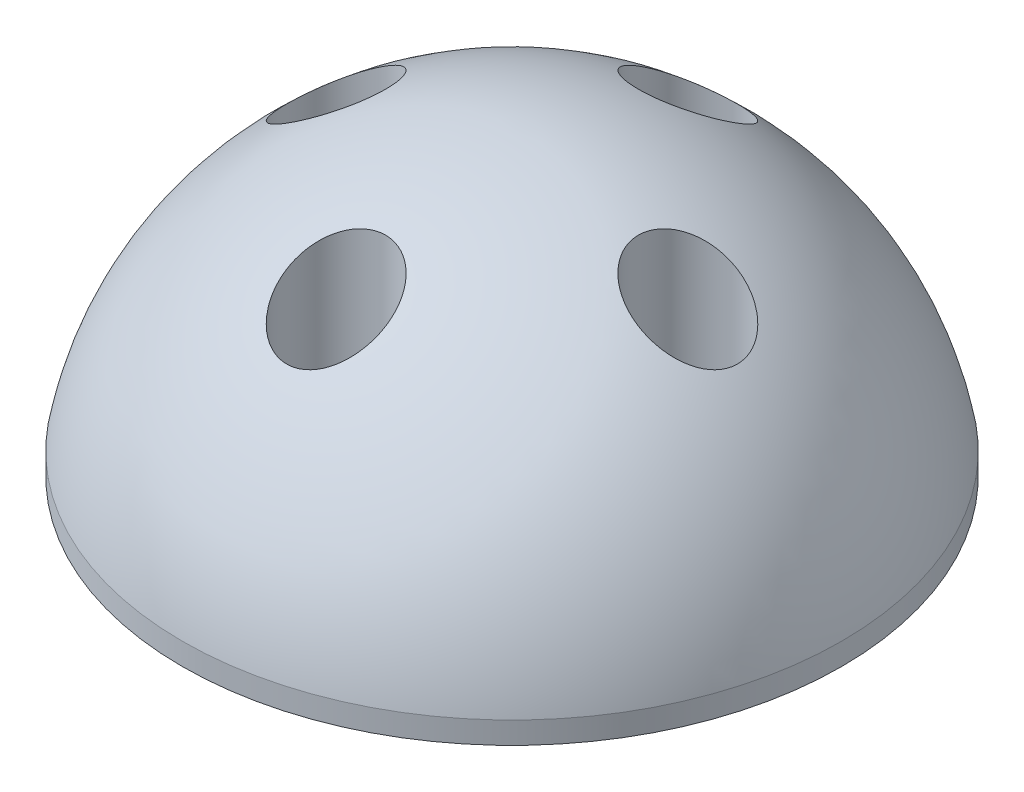
ISO-10303-21;
HEADER;
FILE_DESCRIPTION(('STEP AP214'),'2;1');
FILE_NAME('part.step','',(''),(''),'','','');
FILE_SCHEMA(('AUTOMOTIVE_DESIGN { 1 0 10303 214 1 1 1 1 }'));
ENDSEC;
DATA;
#1=APPLICATION_CONTEXT('core data for automotive mechanical design processes');
#2=APPLICATION_PROTOCOL_DEFINITION('international standard','automotive_design',2000,#1);
#3=PRODUCT_CONTEXT('',#1,'mechanical');
#4=PRODUCT('Part','Part','',(#3));
#5=PRODUCT_RELATED_PRODUCT_CATEGORY('part','',(#4));
#6=PRODUCT_DEFINITION_FORMATION('','',#4);
#7=PRODUCT_DEFINITION_CONTEXT('part definition',#1,'design');
#8=PRODUCT_DEFINITION('design','',#6,#7);
#9=PRODUCT_DEFINITION_SHAPE('','',#8);
#10=(LENGTH_UNIT() NAMED_UNIT(*) SI_UNIT(.MILLI.,.METRE.));
#11=(NAMED_UNIT(*) PLANE_ANGLE_UNIT() SI_UNIT($,.RADIAN.));
#12=(NAMED_UNIT(*) SI_UNIT($,.STERADIAN.) SOLID_ANGLE_UNIT());
#13=UNCERTAINTY_MEASURE_WITH_UNIT(LENGTH_MEASURE(1.E-05),#10,'distance_accuracy_value','');
#14=(GEOMETRIC_REPRESENTATION_CONTEXT(3) GLOBAL_UNCERTAINTY_ASSIGNED_CONTEXT((#13)) GLOBAL_UNIT_ASSIGNED_CONTEXT((#10,
#11,#12)) REPRESENTATION_CONTEXT('',''));
#15=CARTESIAN_POINT('',(0.,0.,0.));
#16=DIRECTION('',(0.,0.,1.));
#17=DIRECTION('',(1.,0.,0.));
#18=AXIS2_PLACEMENT_3D('',#15,#16,#17);
#19=CARTESIAN_POINT('',(0.,1.,0.));
#20=DIRECTION('',(0.,-1.,0.));
#21=DIRECTION('',(0.,0.,-1.));
#22=AXIS2_PLACEMENT_3D('',#19,#20,#21);
#23=CYLINDRICAL_SURFACE('',#22,15.);
#24=CARTESIAN_POINT('',(0.,1.,0.));
#25=DIRECTION('',(0.,1.,0.));
#26=DIRECTION('',(0.,0.,1.));
#27=AXIS2_PLACEMENT_3D('',#24,#25,#26);
#28=CIRCLE('',#27,15.);
#29=CARTESIAN_POINT('',(0.,1.,15.));
#30=VERTEX_POINT('',#29);
#31=EDGE_CURVE('E10',#30,#30,#28,.T.);
#32=ORIENTED_EDGE('',*,*,#31,.F.);
#33=EDGE_LOOP('',(#32));
#34=FACE_BOUND('',#33,.T.);
#35=CARTESIAN_POINT('',(0.,0.,0.));
#36=DIRECTION('',(0.,1.,0.));
#37=DIRECTION('',(0.,0.,1.));
#38=AXIS2_PLACEMENT_3D('',#35,#36,#37);
#39=CIRCLE('',#38,15.);
#40=CARTESIAN_POINT('',(0.,0.,15.));
#41=VERTEX_POINT('',#40);
#42=EDGE_CURVE('E38',#41,#41,#39,.T.);
#43=ORIENTED_EDGE('',*,*,#42,.T.);
#44=EDGE_LOOP('',(#43));
#45=FACE_BOUND('',#44,.T.);
#46=ADVANCED_FACE('F31',(#34,#45),#23,.T.);
#47=CARTESIAN_POINT('',(0.,0.,0.));
#48=DIRECTION('',(0.,1.,0.));
#49=DIRECTION('',(0.,0.,1.));
#50=AXIS2_PLACEMENT_3D('',#47,#48,#49);
#51=PLANE('',#50);
#52=CARTESIAN_POINT('',(-8.,0.,0.));
#53=DIRECTION('',(0.,-1.,0.));
#54=DIRECTION('',(1.,0.,0.));
#55=AXIS2_PLACEMENT_3D('',#52,#53,#54);
#56=CIRCLE('',#55,1.375);
#57=CARTESIAN_POINT('',(-6.625,0.,0.));
#58=VERTEX_POINT('',#57);
#59=EDGE_CURVE('E51',#58,#58,#56,.T.);
#60=ORIENTED_EDGE('',*,*,#59,.F.);
#61=EDGE_LOOP('',(#60));
#62=FACE_BOUND('',#61,.T.);
#63=CARTESIAN_POINT('',(0.,0.,-8.));
#64=DIRECTION('',(0.,-1.,0.));
#65=DIRECTION('',(0.,0.,1.));
#66=AXIS2_PLACEMENT_3D('',#63,#64,#65);
#67=CIRCLE('',#66,1.375);
#68=CARTESIAN_POINT('',(0.,0.,-6.625));
#69=VERTEX_POINT('',#68);
#70=EDGE_CURVE('E170',#69,#69,#67,.T.);
#71=ORIENTED_EDGE('',*,*,#70,.F.);
#72=EDGE_LOOP('',(#71));
#73=FACE_BOUND('',#72,.T.);
#74=CARTESIAN_POINT('',(8.,0.,0.));
#75=DIRECTION('',(0.,-1.,0.));
#76=DIRECTION('',(-1.,0.,0.));
#77=AXIS2_PLACEMENT_3D('',#74,#75,#76);
#78=CIRCLE('',#77,1.375);
#79=CARTESIAN_POINT('',(6.625,0.,0.));
#80=VERTEX_POINT('',#79);
#81=EDGE_CURVE('E172',#80,#80,#78,.T.);
#82=ORIENTED_EDGE('',*,*,#81,.F.);
#83=EDGE_LOOP('',(#82));
#84=FACE_BOUND('',#83,.T.);
#85=CARTESIAN_POINT('',(0.,0.,8.));
#86=DIRECTION('',(0.,-1.,0.));
#87=DIRECTION('',(0.,0.,-1.));
#88=AXIS2_PLACEMENT_3D('',#85,#86,#87);
#89=CIRCLE('',#88,1.375);
#90=CARTESIAN_POINT('',(0.,0.,6.625));
#91=VERTEX_POINT('',#90);
#92=EDGE_CURVE('E43',#91,#91,#89,.T.);
#93=ORIENTED_EDGE('',*,*,#92,.F.);
#94=EDGE_LOOP('',(#93));
#95=FACE_BOUND('',#94,.T.);
#96=ORIENTED_EDGE('',*,*,#42,.F.);
#97=EDGE_LOOP('',(#96));
#98=FACE_BOUND('',#97,.T.);
#99=ADVANCED_FACE('F102',(#62,#73,#84,#95,#98),#51,.F.);
#100=CARTESIAN_POINT('',(0.,-1.74999999999999,0.));
#101=DIRECTION('',(0.,-1.,0.));
#102=DIRECTION('',(1.,0.,0.));
#103=AXIS2_PLACEMENT_3D('',#100,#101,#102);
#104=SPHERICAL_SURFACE('',#103,15.25);
#105=CARTESIAN_POINT('',(-1.44939926503516,9.91037997957821,-9.72097117074058));
#106=CARTESIAN_POINT('',(-1.55753639028746,9.97286645131404,-9.62989232811992));
#107=CARTESIAN_POINT('',(-1.65531452125126,10.040826611451,-9.53009502438769));
#108=CARTESIAN_POINT('',(-1.82907759571313,10.18417611645,-9.31753765402247));
#109=CARTESIAN_POINT('',(-1.90501270070655,10.2595819318576,-9.20474875260493));
#110=CARTESIAN_POINT('',(-2.03422856788474,10.4145178118002,-8.97065442894932));
#111=CARTESIAN_POINT('',(-2.08763841885442,10.4940213620761,-8.84940230869914));
#112=CARTESIAN_POINT('',(-2.17222975098161,10.6552932584435,-8.60095046624146));
#113=CARTESIAN_POINT('',(-2.20342015356581,10.7370606818421,-8.47375315299891));
#114=CARTESIAN_POINT('',(-2.24571580913105,10.9106030397579,-8.20109365501086));
#115=CARTESIAN_POINT('',(-2.25405651127421,11.002433649087,-8.05523051011659));
#116=CARTESIAN_POINT('',(-2.24228415838746,11.1842572743215,-7.7633291595774));
#117=CARTESIAN_POINT('',(-2.22214940919226,11.2742488361347,-7.6172909052433));
#118=CARTESIAN_POINT('',(-2.15229963313588,11.4512699278702,-7.32715182819221));
#119=CARTESIAN_POINT('',(-2.10211961254348,11.5382296594951,-7.18311867544966));
#120=CARTESIAN_POINT('',(-1.97147317884518,11.7047099641709,-6.90485571153108));
#121=CARTESIAN_POINT('',(-1.89104996300138,11.7842409466115,-6.77061224243894));
#122=CARTESIAN_POINT('',(-1.72288918267863,11.9152157153829,-6.54782044671053));
#123=CARTESIAN_POINT('',(-1.6412751876572,11.9688754067362,-6.45593328094426));
#124=CARTESIAN_POINT('',(-1.46152875525929,12.0682902994611,-6.28483249653054));
#125=CARTESIAN_POINT('',(-1.36340422824459,12.1140492649779,-6.20561284403239));
#126=CARTESIAN_POINT('',(-1.15175316513579,12.1961563308302,-6.06290168328497));
#127=CARTESIAN_POINT('',(-1.03813648982296,12.2324454357509,-5.99950887431793));
#128=CARTESIAN_POINT('',(-0.799032294503142,12.2934832246265,-5.89259496041249));
#129=CARTESIAN_POINT('',(-0.673552477799625,12.3182393364256,-5.84906106568278));
#130=CARTESIAN_POINT('',(-0.429721805476774,12.3527719138515,-5.7882554797348));
#131=CARTESIAN_POINT('',(-0.312163130041493,12.3639229762541,-5.76857553066206));
#132=CARTESIAN_POINT('',(-0.0749118359341102,12.3755227127939,-5.74810282220485));
#133=CARTESIAN_POINT('',(0.0447796684070115,12.3759768206301,-5.74730047362406));
#134=CARTESIAN_POINT('',(0.273983702838342,12.3665178418211,-5.76399627686657));
#135=CARTESIAN_POINT('',(0.383622762836628,12.3573274649437,-5.7802186821262));
#136=CARTESIAN_POINT('',(0.598275348546068,12.3300846208255,-5.8282125663884));
#137=CARTESIAN_POINT('',(0.703288961594765,12.3120323209935,-5.85998375166211));
#138=CARTESIAN_POINT('',(0.907564429773527,12.2674569390585,-5.93821258891502));
#139=CARTESIAN_POINT('',(1.00672042833327,12.2408144857661,-5.98487710426091));
#140=CARTESIAN_POINT('',(1.19552964802438,12.1800997849856,-6.09082746759711));
#141=CARTESIAN_POINT('',(1.28518020910026,12.1460254658348,-6.15011683470651));
#142=CARTESIAN_POINT('',(1.46065280941568,12.0683326785431,-6.28470697467165));
#143=CARTESIAN_POINT('',(1.54550944597059,12.0241506773429,-6.36093792688761));
#144=CARTESIAN_POINT('',(1.70122759197386,11.9295942575242,-6.52318360614259));
#145=CARTESIAN_POINT('',(1.77208290308634,11.8792171122766,-6.6092026398941));
#146=CARTESIAN_POINT('',(1.90732882660972,11.7667751262805,-6.80002075856474));
#147=CARTESIAN_POINT('',(1.96975229527907,11.7040386316007,-6.90581709338097));
#148=CARTESIAN_POINT('',(2.07588239748621,11.573858111756,-7.12369059440206));
#149=CARTESIAN_POINT('',(2.11957926261992,11.5064116509997,-7.2357710041989));
#150=CARTESIAN_POINT('',(2.19301918244425,11.3588432092539,-7.47902339905344));
#151=CARTESIAN_POINT('',(2.2200640155828,11.2782431597585,-7.61072219237385));
#152=CARTESIAN_POINT('',(2.25049755078715,11.1146973239077,-7.87539134262225));
#153=CARTESIAN_POINT('',(2.25387506599088,11.0317504468696,-8.00836227112143));
#154=CARTESIAN_POINT('',(2.23651498525113,10.8569192185404,-8.28587272756411));
#155=CARTESIAN_POINT('',(2.21331232432847,10.7649767456394,-8.43022733497413));
#156=CARTESIAN_POINT('',(2.13905134785191,10.5829056747608,-8.7129832685379));
#157=CARTESIAN_POINT('',(2.08797099857956,10.4927785701001,-8.85137979212347));
#158=CARTESIAN_POINT('',(1.95720338170618,10.315943511406,-9.12005872134845));
#159=CARTESIAN_POINT('',(1.87708691998855,10.22930976149,-9.2501829985555));
#160=CARTESIAN_POINT('',(1.68879399326153,10.0648722486334,-9.4947202071397));
#161=CARTESIAN_POINT('',(1.58067196938884,9.98705177044164,-9.60916296969372));
#162=CARTESIAN_POINT('',(1.37325963340152,9.86585873428572,-9.78589875357593));
#163=CARTESIAN_POINT('',(1.28060338007034,9.8190614549035,-9.85366327224271));
#164=CARTESIAN_POINT('',(1.0830065634869,9.73442408736816,-9.9756118647176));
#165=CARTESIAN_POINT('',(0.978074308345092,9.69657799307902,-10.0298050461716));
#166=CARTESIAN_POINT('',(0.757149773153857,9.63183431563998,-10.12218219432));
#167=CARTESIAN_POINT('',(0.641080590166459,9.60502079940393,-10.1602433002798));
#168=CARTESIAN_POINT('',(0.40209783650282,9.56484154515619,-10.2171736139344));
#169=CARTESIAN_POINT('',(0.279190348970403,9.55146405052528,-10.23605960016));
#170=CARTESIAN_POINT('',(0.0469971998769583,9.54008186001084,-10.2521296366751));
#171=CARTESIAN_POINT('',(-0.0620416139044836,9.54034437443422,-10.2517598702495));
#172=CARTESIAN_POINT('',(-0.278324075675924,9.55196621478245,-10.2353495778451));
#173=CARTESIAN_POINT('',(-0.385567887667622,9.56332452124028,-10.2193104915431));
#174=CARTESIAN_POINT('',(-0.590662141653247,9.59565385802585,-10.1735238795463));
#175=CARTESIAN_POINT('',(-0.688717961416461,9.61620015110733,-10.1443817787475));
#176=CARTESIAN_POINT('',(-0.878109249429696,9.66560434692044,-10.0740364665));
#177=CARTESIAN_POINT('',(-0.969446430846786,9.69446012155249,-10.0328363431266));
#178=CARTESIAN_POINT('',(-1.12791674457398,9.75321639604519,-9.94854424017289));
#179=CARTESIAN_POINT('',(-1.19641882189885,9.78195734345236,-9.90718117015471));
#180=CARTESIAN_POINT('',(-1.32745628132129,9.84337455989514,-9.81841334138899));
#181=CARTESIAN_POINT('',(-1.3899910331651,9.87605124379054,-9.77100794569868));
#182=CARTESIAN_POINT('',(-1.44939926503516,9.91037997957821,-9.72097117074058));
#183=B_SPLINE_CURVE_WITH_KNOTS('',3,(#105,#106,#107,#108,#109,#110,#111,#112,#113,#114,#115,
#116,#117,#118,#119,#120,#121,#122,#123,#124,#125,#126,#127,#128,#129,#130,#131,#132,#133,#134,
#135,#136,#137,#138,#139,#140,#141,#142,#143,#144,#145,#146,#147,#148,#149,#150,#151,#152,#153,
#154,#155,#156,#157,#158,#159,#160,#161,#162,#163,#164,#165,#166,#167,#168,#169,#170,#171,#172,
#173,#174,#175,#176,#177,#178,#179,#180,#181,#182),.UNSPECIFIED.,.T.,.F.,(4,2,2,2,2,2,2,2,2,2,2,
2,2,2,2,2,2,2,2,2,2,2,2,2,2,2,2,2,2,2,2,2,2,2,2,2,2,2,4),(0.,0.463381419812173,0.92781188404503,
1.38954336037231,1.85108934024941,2.36642747933686,2.88215844293605,3.40608520882776,
3.92926645939435,4.32992605145905,4.73039422724624,5.13330069710613,5.53594731437824,
5.89318030071941,6.25023182060585,6.58231637239128,6.91439465107638,7.25130228747646,
7.58830395854729,7.95381359964854,8.31948468980851,8.73164534472841,9.14402073510117,
9.61235600893284,10.0809126364866,10.5966987150199,11.1128930475719,11.6370513196303,
12.1601982081796,12.5306439891106,12.9008404957597,13.2738078259151,13.6464485218114,
13.9718817508107,14.297285082238,14.6089917045173,14.9206185680684,15.1751635892817,
15.4297354652054),.UNSPECIFIED.);
#184=CARTESIAN_POINT('',(-1.44939926503516,9.91037997957821,-9.72097117074058));
#185=VERTEX_POINT('',#184);
#186=EDGE_CURVE('E236',#185,#185,#183,.T.);
#187=ORIENTED_EDGE('',*,*,#186,.F.);
#188=EDGE_LOOP('',(#187));
#189=FACE_BOUND('',#188,.T.);
#190=CARTESIAN_POINT('',(9.3118631479231,10.1877631754542,-1.82798114900603));
#191=CARTESIAN_POINT('',(9.17499467317678,10.2794820032948,-1.92620023843682));
#192=CARTESIAN_POINT('',(9.02903842710733,10.3762185541791,-2.00763274366949));
#193=CARTESIAN_POINT('',(8.72556251941894,10.5748094416303,-2.13620318368798));
#194=CARTESIAN_POINT('',(8.56800673987517,10.6766794224116,-2.18322854346389));
#195=CARTESIAN_POINT('',(8.26716239451514,10.8687741577365,-2.23863855362489));
#196=CARTESIAN_POINT('',(8.12453252381125,10.9588736835668,-2.25109729203282));
#197=CARTESIAN_POINT('',(7.83871080105058,11.1375364869626,-2.24875259119156));
#198=CARTESIAN_POINT('',(7.69551972453097,11.2261013220266,-2.23397865045771));
#199=CARTESIAN_POINT('',(7.40662153735848,11.4030297719659,-2.17554327917133));
#200=CARTESIAN_POINT('',(7.2610476854913,11.491239734308,-2.13073525756814));
#201=CARTESIAN_POINT('',(6.97854588017341,11.6608334666695,-2.01063760490342));
#202=CARTESIAN_POINT('',(6.84161824502729,11.7422169854141,-1.93534685239621));
#203=CARTESIAN_POINT('',(6.59348594528057,11.8885165807754,-1.76214972496717));
#204=CARTESIAN_POINT('',(6.48108882949479,11.9542395378083,-1.66664790091339));
#205=CARTESIAN_POINT('',(6.27454226605322,12.0742875747271,-1.4516963099501));
#206=CARTESIAN_POINT('',(6.18036811224357,12.1286280949534,-1.33227942005502));
#207=CARTESIAN_POINT('',(6.02844382916166,12.215905705915,-1.09205584836815));
#208=CARTESIAN_POINT('',(5.96736487216066,12.2508207662912,-0.974074276416953));
#209=CARTESIAN_POINT('',(5.86638619570202,12.3084017070218,-0.726622631136961));
#210=CARTESIAN_POINT('',(5.82646202442883,12.3310817298284,-0.597166024265667));
#211=CARTESIAN_POINT('',(5.77424985470585,12.360711849006,-0.349721336581895));
#212=CARTESIAN_POINT('',(5.75894152385788,12.3693818683521,-0.232568320002699));
#213=CARTESIAN_POINT('',(5.74691924520478,12.3761922185896,0.0029760895927413));
#214=CARTESIAN_POINT('',(5.75019698897675,12.3743372544019,0.121366905661497));
#215=CARTESIAN_POINT('',(5.77436049693795,12.3606439079919,0.348171734908263));
#216=CARTESIAN_POINT('',(5.7941307177224,12.3494380044517,0.456746233258493));
#217=CARTESIAN_POINT('',(5.84887061090577,12.3183442569035,0.668670390857834));
#218=CARTESIAN_POINT('',(5.88384055437397,12.2984562580605,0.77201995688969));
#219=CARTESIAN_POINT('',(5.96843493250253,12.25020118885,0.973370533728332));
#220=CARTESIAN_POINT('',(6.01838374598722,12.2216462432915,1.07118931923119));
#221=CARTESIAN_POINT('',(6.13059539593385,12.157246623375,1.25682235552224));
#222=CARTESIAN_POINT('',(6.192861961034,12.1213997416223,1.34463356425575));
#223=CARTESIAN_POINT('',(6.33370619858222,12.0399420665577,1.51637392875694));
#224=CARTESIAN_POINT('',(6.41325153810211,11.9937402651579,1.59922668596096));
#225=CARTESIAN_POINT('',(6.58178362864816,11.8952880978466,1.75042797775998));
#226=CARTESIAN_POINT('',(6.67077465136287,11.8430349943307,1.81876990774125));
#227=CARTESIAN_POINT('',(6.86777709498188,11.7266231596952,1.94838789887908));
#228=CARTESIAN_POINT('',(6.9767575884188,11.661799623962,2.00759264831799));
#229=CARTESIAN_POINT('',(7.20053243391502,11.5276499637102,2.10673941866689));
#230=CARTESIAN_POINT('',(7.31532980275389,11.4583214974465,2.1466713288336));
#231=CARTESIAN_POINT('',(7.56367763943427,11.3070901491596,2.21149734292456));
#232=CARTESIAN_POINT('',(7.6976776826392,11.2247481767652,2.2336550017497));
#233=CARTESIAN_POINT('',(7.96626308978209,11.0580735325247,2.25377903262564));
#234=CARTESIAN_POINT('',(8.10084870003961,10.9737399398247,2.25173398666376));
#235=CARTESIAN_POINT('',(8.38002279196547,10.7970370981523,2.22251679120829));
#236=CARTESIAN_POINT('',(8.52436522057736,10.7046562000776,2.19300542216439));
#237=CARTESIAN_POINT('',(8.80612768247516,10.5223376975535,2.10580704759386));
#238=CARTESIAN_POINT('',(8.94354229091621,10.432402032477,2.04809832881228));
#239=CARTESIAN_POINT('',(9.20739096892856,10.257888079989,1.90455728001718));
#240=CARTESIAN_POINT('',(9.33379318404907,10.1733255140988,1.81864658153924));
#241=CARTESIAN_POINT('',(9.56980133487906,10.0139068173393,1.6192509235582));
#242=CARTESIAN_POINT('',(9.67944301441332,9.93903008429269,1.50582601746863));
#243=CARTESIAN_POINT('',(9.84569420577663,9.82458969111819,1.29162967755319));
#244=CARTESIAN_POINT('',(9.90828950059812,9.78121317486628,1.19750768574837));
#245=CARTESIAN_POINT('',(10.0197821085223,9.7036015627878,0.997999881559525));
#246=CARTESIAN_POINT('',(10.06868940304,9.66935980666819,0.892622354696768));
#247=CARTESIAN_POINT('',(10.1505278122677,9.61188355945163,0.672052253394602));
#248=CARTESIAN_POINT('',(10.1833461454569,9.58872679861861,0.556796863010462));
#249=CARTESIAN_POINT('',(10.2302680668558,9.55557370262242,0.320705063236427));
#250=CARTESIAN_POINT('',(10.2443846572916,9.54556822418106,0.199872591810419));
#251=CARTESIAN_POINT('',(10.2523764736312,9.5399059918864,-0.0285995176470327));
#252=CARTESIAN_POINT('',(10.2484227031872,9.54271023359965,-0.136132190389769));
#253=CARTESIAN_POINT('',(10.2253823032102,9.55902067126726,-0.348706717884452));
#254=CARTESIAN_POINT('',(10.2062982336439,9.57252505681368,-0.453748990902702));
#255=CARTESIAN_POINT('',(10.1547815295319,9.6088648509215,-0.655750974718902));
#256=CARTESIAN_POINT('',(10.1227101605322,9.63144761299152,-0.752850060568632));
#257=CARTESIAN_POINT('',(10.0467565223149,9.6847103928787,-0.93994277667585));
#258=CARTESIAN_POINT('',(10.002868221996,9.71539454531137,-1.02993274817935));
#259=CARTESIAN_POINT('',(9.90007763385895,9.78690410925218,-1.20995822256822));
#260=CARTESIAN_POINT('',(9.84011425536744,9.82843588995477,-1.29910246996318));
#261=CARTESIAN_POINT('',(9.7101396167428,9.91789448945606,-1.46598296136204));
#262=CARTESIAN_POINT('',(9.64013394067942,9.96581775320481,-1.54372549707797));
#263=CARTESIAN_POINT('',(9.52593206712948,10.0434658012903,-1.65443753352468));
#264=CARTESIAN_POINT('',(9.48457739944596,10.0714879373215,-1.69162094543679));
#265=CARTESIAN_POINT('',(9.39975530048486,10.1287515890462,-1.76245271852147));
#266=CARTESIAN_POINT('',(9.35628793277794,10.1579930680463,-1.79610118596349));
#267=CARTESIAN_POINT('',(9.3118631479231,10.1877631754542,-1.82798114900603));
#268=B_SPLINE_CURVE_WITH_KNOTS('',3,(#190,#191,#192,#193,#194,#195,#196,#197,#198,#199,#200,
#201,#202,#203,#204,#205,#206,#207,#208,#209,#210,#211,#212,#213,#214,#215,#216,#217,#218,#219,
#220,#221,#222,#223,#224,#225,#226,#227,#228,#229,#230,#231,#232,#233,#234,#235,#236,#237,#238,
#239,#240,#241,#242,#243,#244,#245,#246,#247,#248,#249,#250,#251,#252,#253,#254,#255,#256,#257,
#258,#259,#260,#261,#262,#263,#264,#265,#266,#267),.UNSPECIFIED.,.T.,.F.,(4,2,2,2,2,2,2,2,2,2,2,
2,2,2,2,2,2,2,2,2,2,2,2,2,2,2,2,2,2,2,2,2,2,2,2,2,2,2,4),(0.,0.57514533925969,1.15216415403988,
1.6575106357345,2.16231004632923,2.687569887803,3.21284905510142,3.69439883578572,
4.17529109949698,4.58496271962688,4.99415978105788,5.34769993532537,5.70108206109359,
6.03233390240133,6.36359165144082,6.7026164036898,7.04174393770794,7.41166316320176,
7.78175039848459,8.19991573701731,8.6183002118734,9.09281908485895,9.56756182862448,
10.0868410145706,10.6065207010397,11.1276568886919,11.6476657031001,12.0094642606035,
12.3709982997829,12.7350316439938,13.0988117640953,13.4201153724676,13.7413646295677,
14.0542322430223,14.367259840893,14.7115187827683,15.055587034475,15.2422733869516,
15.4289541255529),.UNSPECIFIED.);
#269=CARTESIAN_POINT('',(9.3118631479231,10.1877631754542,-1.82798114900603));
#270=VERTEX_POINT('',#269);
#271=EDGE_CURVE('E60',#270,#270,#268,.T.);
#272=ORIENTED_EDGE('',*,*,#271,.F.);
#273=EDGE_LOOP('',(#272));
#274=FACE_BOUND('',#273,.T.);
#275=CARTESIAN_POINT('',(-1.92759306885052,10.288734996467,9.16055373030253));
#276=CARTESIAN_POINT('',(-1.86264496764097,10.2170528414282,9.26842189471487));
#277=CARTESIAN_POINT('',(-1.7878867907352,10.1475179767008,9.37208909271781));
#278=CARTESIAN_POINT('',(-1.61906823573737,10.015219174497,9.56775061287258));
#279=CARTESIAN_POINT('',(-1.52497879217263,9.95246565245974,9.65972701630707));
#280=CARTESIAN_POINT('',(-1.33436203467533,9.84570659266776,9.81512442987307));
#281=CARTESIAN_POINT('',(-1.24043742116043,9.80030205217763,9.88076162657637));
#282=CARTESIAN_POINT('',(-1.04070635807505,9.71866977136673,9.99820513020227));
#283=CARTESIAN_POINT('',(-0.934911153396397,9.68243345027044,10.0500243721775));
#284=CARTESIAN_POINT('',(-0.712750028391606,9.62107028333923,10.1374824299878));
#285=CARTESIAN_POINT('',(-0.596311400093322,9.59602799164279,10.1729981495701));
#286=CARTESIAN_POINT('',(-0.357191722530516,9.55942873736379,10.2248231122881));
#287=CARTESIAN_POINT('',(-0.23451554324996,9.54786141789594,10.241147106304));
#288=CARTESIAN_POINT('',(-0.00344247588537207,9.53975941076964,10.2525837543686));
#289=CARTESIAN_POINT('',(0.104781397997663,9.54149655220274,10.2501348546414));
#290=CARTESIAN_POINT('',(0.319021493376862,9.55584912902544,10.2298641533908));
#291=CARTESIAN_POINT('',(0.425038080409001,9.56846274831131,10.2120449183344));
#292=CARTESIAN_POINT('',(0.628378251501909,9.60312950972995,10.1629208721408));
#293=CARTESIAN_POINT('',(0.725873894231089,9.62485342660121,10.1320861777555));
#294=CARTESIAN_POINT('',(0.913921334676605,9.67648461922886,10.0585070513144));
#295=CARTESIAN_POINT('',(1.00447143373711,9.70639388874013,10.0157597175799));
#296=CARTESIAN_POINT('',(1.18537791723015,9.7762154354557,9.9154802074527));
#297=CARTESIAN_POINT('',(1.27490551431889,9.81680636308518,9.85693189337411));
#298=CARTESIAN_POINT('',(1.4428447987153,9.90448136163653,9.72968674437064));
#299=CARTESIAN_POINT('',(1.52125056562719,9.95156886471748,9.6609845437433));
#300=CARTESIAN_POINT('',(1.67837131657619,10.058916157382,9.5033016523347));
#301=CARTESIAN_POINT('',(1.75499585741803,10.1200667784004,9.41284607536557));
#302=CARTESIAN_POINT('',(1.89197449009418,10.2470917217823,9.22336471032576));
#303=CARTESIAN_POINT('',(1.95231860387658,10.3129689098287,9.12433371538493));
#304=CARTESIAN_POINT('',(2.06546544562134,10.4593099462941,8.90243525324327));
#305=CARTESIAN_POINT('',(2.11522139429147,10.540343858875,8.77838491385994));
#306=CARTESIAN_POINT('',(2.19198740104546,10.7043977854711,8.52467011655922));
#307=CARTESIAN_POINT('',(2.21898469881972,10.7874188868734,8.39500255195502));
#308=CARTESIAN_POINT('',(2.25164540752186,10.9626957055615,8.11849100381988));
#309=CARTESIAN_POINT('',(2.25463099121893,11.0549612057782,7.97132843950644));
#310=CARTESIAN_POINT('',(2.23165852223935,11.2371353827117,7.67766386126106));
#311=CARTESIAN_POINT('',(2.20568578518202,11.3270428400242,7.53116222031323));
#312=CARTESIAN_POINT('',(2.12405000929359,11.5023338702655,7.24271034918922));
#313=CARTESIAN_POINT('',(2.06824621811057,11.5876938696775,7.10078510613228));
#314=CARTESIAN_POINT('',(1.92664380105403,11.7504507184267,6.82777724404966));
#315=CARTESIAN_POINT('',(1.84089046204912,11.8278593636238,6.69667862203884));
#316=CARTESIAN_POINT('',(1.66465003470599,11.953973754551,6.48150486963055));
#317=CARTESIAN_POINT('',(1.58036253076893,12.005086156281,6.39373911660053));
#318=CARTESIAN_POINT('',(1.39609910579021,12.0992657201048,6.23125330506438));
#319=CARTESIAN_POINT('',(1.29613115277821,12.142336944113,6.15652666124636));
#320=CARTESIAN_POINT('',(1.08178677215451,12.2189805477208,6.02306670622157));
#321=CARTESIAN_POINT('',(0.967329331171646,12.2524957755441,5.96442969804583));
#322=CARTESIAN_POINT('',(0.727655113854467,12.3080537431815,5.86699407372581));
#323=CARTESIAN_POINT('',(0.602444775909377,12.3301032931306,5.82818368163886));
#324=CARTESIAN_POINT('',(0.359603438658921,12.3598140545542,5.77583391322539));
#325=CARTESIAN_POINT('',(0.242620029703251,12.3687748347353,5.76001301433941));
#326=CARTESIAN_POINT('',(0.00731010817956907,12.3761845488363,5.74693290831934));
#327=CARTESIAN_POINT('',(-0.111015782065533,12.3746381694663,5.74966542544838));
#328=CARTESIAN_POINT('',(-0.337911020732221,12.3615411202472,5.77277769508829));
#329=CARTESIAN_POINT('',(-0.44663166925891,12.3506140746959,5.79205737696644));
#330=CARTESIAN_POINT('',(-0.658930254947215,12.3200537676255,5.84586366548065));
#331=CARTESIAN_POINT('',(-0.762508116558348,12.3004203782473,5.88039049603238));
#332=CARTESIAN_POINT('',(-0.96426547849636,12.2526775435639,5.9641000388208));
#333=CARTESIAN_POINT('',(-1.06227354208246,12.2243891910644,6.01359181137589));
#334=CARTESIAN_POINT('',(-1.2483546488339,12.1605033848222,6.1249321275343));
#335=CARTESIAN_POINT('',(-1.33642471428802,12.1249037493707,6.18678435938691));
#336=CARTESIAN_POINT('',(-1.5086926394587,12.043972399328,6.32675639174019));
#337=CARTESIAN_POINT('',(-1.59182980604503,11.9980533525068,6.40583896474321));
#338=CARTESIAN_POINT('',(-1.74367315006861,11.9001454188064,6.57349553809774));
#339=CARTESIAN_POINT('',(-1.81237243910919,11.8481536529177,6.66207403871583));
#340=CARTESIAN_POINT('',(-1.94279707856365,11.7322896413893,6.85822717386926));
#341=CARTESIAN_POINT('',(-2.00246408796006,11.6677509884714,6.96677582718791));
#342=CARTESIAN_POINT('',(-2.1026003055858,11.5341515941598,7.18973662528871));
#343=CARTESIAN_POINT('',(-2.14306250197185,11.4650892115702,7.30415089479082));
#344=CARTESIAN_POINT('',(-2.20909397087492,11.3144020652428,7.55173738017897));
#345=CARTESIAN_POINT('',(-2.2319402714189,11.2323342070681,7.68536837691267));
#346=CARTESIAN_POINT('',(-2.25354036448462,11.0660826982114,7.9534342874779));
#347=CARTESIAN_POINT('',(-2.25226255634448,10.9818964166568,8.08787002512174));
#348=CARTESIAN_POINT('',(-2.22469110641973,10.8052347739462,8.3671631336711));
#349=CARTESIAN_POINT('',(-2.19599641806244,10.7127431327674,8.51177497095542));
#350=CARTESIAN_POINT('',(-2.11045890810591,10.5303896309544,8.79376819563768));
#351=CARTESIAN_POINT('',(-2.05370190583974,10.440520631739,8.93117022353088));
#352=CARTESIAN_POINT('',(-1.96552431647301,10.3317571083193,9.09572699314));
#353=CARTESIAN_POINT('',(-1.94699648255597,10.3101502262215,9.12832783638475));
#354=CARTESIAN_POINT('',(-1.92759306885052,10.288734996467,9.16055373030253));
#355=B_SPLINE_CURVE_WITH_KNOTS('',3,(#275,#276,#277,#278,#279,#280,#281,#282,#283,#284,#285,
#286,#287,#288,#289,#290,#291,#292,#293,#294,#295,#296,#297,#298,#299,#300,#301,#302,#303,#304,
#305,#306,#307,#308,#309,#310,#311,#312,#313,#314,#315,#316,#317,#318,#319,#320,#321,#322,#323,
#324,#325,#326,#327,#328,#329,#330,#331,#332,#333,#334,#335,#336,#337,#338,#339,#340,#341,#342,
#343,#344,#345,#346,#347,#348,#349,#350,#351,#352,#353,#354),.UNSPECIFIED.,.T.,.F.,(4,2,2,2,2,2,
2,2,2,2,2,2,2,2,2,2,2,2,2,2,2,2,2,2,2,2,2,2,2,2,2,2,2,2,2,2,2,2,2,4),(0.,0.434558191787552,
0.869774607670535,1.23802530215759,1.60593005555495,1.97656866706635,2.34692221679521,
2.67006943261215,2.99316270125489,3.30546861565673,3.61785066807088,3.959786129076,
4.30190293224361,4.70056082950287,5.09946250655262,5.56647269230006,6.0337445472734,
6.55249223371842,7.07150308992554,7.59298470214082,8.11368116908689,8.50800966200353,
8.90213842196187,9.2985771507154,9.69478014164272,10.0480772999816,10.4012168807516,
10.7325513767851,11.0638907388726,11.4026039143422,11.7414183100797,12.1107058488257,
12.4801691788478,12.8975244130247,13.3150319102121,13.7884980805744,14.2625844969094,
14.7823995408167,15.3006346438901,15.4304600308886),.UNSPECIFIED.);
#356=CARTESIAN_POINT('',(-1.92759306885052,10.288734996467,9.16055373030253));
#357=VERTEX_POINT('',#356);
#358=EDGE_CURVE('E56',#357,#357,#355,.T.);
#359=ORIENTED_EDGE('',*,*,#358,.F.);
#360=EDGE_LOOP('',(#359));
#361=FACE_BOUND('',#360,.T.);
#362=CARTESIAN_POINT('',(-9.71396757494951,9.91518404487504,-1.45767456999961));
#363=CARTESIAN_POINT('',(-9.78518073834118,9.86634736594571,-1.37394668283048));
#364=CARTESIAN_POINT('',(-9.85117243312397,9.82078031280843,-1.28391312974622));
#365=CARTESIAN_POINT('',(-9.97035741416121,9.73808012984728,-1.09219917118741));
#366=CARTESIAN_POINT('',(-10.023559788512,9.70094101218614,-0.990527112332898));
#367=CARTESIAN_POINT('',(-10.1149288492328,9.63693024996834,-0.77664925825208));
#368=CARTESIAN_POINT('',(-10.1529896867802,9.61013092496393,-0.664375870143031));
#369=CARTESIAN_POINT('',(-10.2111414560507,9.56910635087761,-0.433057231620487));
#370=CARTESIAN_POINT('',(-10.2312447137319,9.55487247703613,-0.314016685923378));
#371=CARTESIAN_POINT('',(-10.2510229880268,9.54086682569798,-0.0852491646157559));
#372=CARTESIAN_POINT('',(-10.252508635164,9.53981323692848,0.0242457991812379));
#373=CARTESIAN_POINT('',(-10.2396197137024,9.54894265701938,0.241804759901348));
#374=CARTESIAN_POINT('',(-10.2252480009513,9.55912364257741,0.349869010943616));
#375=CARTESIAN_POINT('',(-10.1825823340714,9.58926328701822,0.556252800213472));
#376=CARTESIAN_POINT('',(-10.1549850358638,9.60873248093811,0.654791288701172));
#377=CARTESIAN_POINT('',(-10.0875813626,9.65610609217797,0.845418815867969));
#378=CARTESIAN_POINT('',(-10.0477724747915,9.68401224553574,0.937506522388793));
#379=CARTESIAN_POINT('',(-9.9538759384265,9.7495277461443,1.12086070524982));
#380=CARTESIAN_POINT('',(-9.89888772229024,9.78774338379903,1.21144599782603));
#381=CARTESIAN_POINT('',(-9.77858663493863,9.87085805434259,1.38204245736228));
#382=CARTESIAN_POINT('',(-9.71326857886224,9.9157604428511,1.46204827693521));
#383=CARTESIAN_POINT('',(-9.56305268723052,10.0183551729017,1.62275051764349));
#384=CARTESIAN_POINT('',(-9.47669435222368,10.0769442591379,1.70150697759945));
#385=CARTESIAN_POINT('',(-9.29517785608483,10.1990959777725,1.84345063608314));
#386=CARTESIAN_POINT('',(-9.20001435804227,10.2626616228817,1.90662830598315));
#387=CARTESIAN_POINT('',(-8.98592191122097,10.4044681870476,2.02682627593793));
#388=CARTESIAN_POINT('',(-8.86573608217185,10.4833403700864,2.08087106046491));
#389=CARTESIAN_POINT('',(-8.61925224806429,10.6434818660734,2.16704721544249));
#390=CARTESIAN_POINT('',(-8.4929508036749,10.7247525176127,2.19916609813928));
#391=CARTESIAN_POINT('',(-8.22154393102109,10.897672959131,2.24377659331658));
#392=CARTESIAN_POINT('',(-8.07600812489972,10.9893921201453,2.25343304870157));
#393=CARTESIAN_POINT('',(-7.78460013729292,11.1710937611367,2.24440753882935));
#394=CARTESIAN_POINT('',(-7.63872781232343,11.2610752317799,2.22570957730737));
#395=CARTESIAN_POINT('',(-7.34827933613006,11.4384624333711,2.15879188574258));
#396=CARTESIAN_POINT('',(-7.20377811041466,11.5257888166985,2.11002801757535));
#397=CARTESIAN_POINT('',(-6.92431363497976,11.6931382624023,1.98215473113176));
#398=CARTESIAN_POINT('',(-6.78933766639468,11.7731711069703,1.903086721283));
#399=CARTESIAN_POINT('',(-6.56470385255421,11.9053306737709,1.73700061031977));
#400=CARTESIAN_POINT('',(-6.47179548757317,11.9596248143823,1.65607839971773));
#401=CARTESIAN_POINT('',(-6.29855613470341,12.0603451728599,1.47750922172596));
#402=CARTESIAN_POINT('',(-6.21821923204026,12.1067750916333,1.37987016503839));
#403=CARTESIAN_POINT('',(-6.07320246269497,12.190248236911,1.16894279651351));
#404=CARTESIAN_POINT('',(-6.00862181272008,12.2272320465279,1.05556203246227));
#405=CARTESIAN_POINT('',(-5.89933467057009,12.2896448765381,0.816650537230055));
#406=CARTESIAN_POINT('',(-5.85461511369275,12.3150814929634,0.691127859430548));
#407=CARTESIAN_POINT('',(-5.79168549669422,12.3508267142659,0.44708498378029));
#408=CARTESIAN_POINT('',(-5.77103698357116,12.3625279347796,0.329394548002407));
#409=CARTESIAN_POINT('',(-5.74870662319749,12.3751809768806,0.091678691684211));
#410=CARTESIAN_POINT('',(-5.74701486749821,12.3761384141031,-0.0283454761769864));
#411=CARTESIAN_POINT('',(-5.76210415541063,12.3675899525124,-0.258114545272516));
#412=CARTESIAN_POINT('',(-5.77756524667486,12.3588317033446,-0.367977854640528));
#413=CARTESIAN_POINT('',(-5.82411191877612,12.3324139369629,-0.583208900561957));
#414=CARTESIAN_POINT('',(-5.85519706311804,12.3147546684201,-0.688576762617175));
#415=CARTESIAN_POINT('',(-5.93206827955518,12.2709625028197,-0.893468976878272));
#416=CARTESIAN_POINT('',(-5.97803484560117,12.2447255277897,-0.992902852128324));
#417=CARTESIAN_POINT('',(-6.08265466583482,12.1847917549796,-1.18237480385602));
#418=CARTESIAN_POINT('',(-6.14131138956411,12.1510929170358,-1.27241030077819));
#419=CARTESIAN_POINT('',(-6.27457483336736,12.0741960740366,-1.44865678614768));
#420=CARTESIAN_POINT('',(-6.35010275687879,12.0304408841805,-1.5339257212368));
#421=CARTESIAN_POINT('',(-6.51101391898115,11.9367079736536,-1.69057602193757));
#422=CARTESIAN_POINT('',(-6.5964014623031,11.8867275342704,-1.7619512847376));
#423=CARTESIAN_POINT('',(-6.78590138280406,11.7751271751789,-1.8983565135112));
#424=CARTESIAN_POINT('',(-6.89101609217416,11.7128346489861,-1.96144191895632));
#425=CARTESIAN_POINT('',(-7.10762371094395,11.5834995463301,-2.06901182502647));
#426=CARTESIAN_POINT('',(-7.21911995145517,11.5164544846432,-2.11348650845184));
#427=CARTESIAN_POINT('',(-7.46126541103315,11.3696735480788,-2.18870779867408));
#428=CARTESIAN_POINT('',(-7.59245747143458,11.2894516537241,-2.21676540910422));
#429=CARTESIAN_POINT('',(-7.8562496586471,11.1265930261363,-2.2493376111665));
#430=CARTESIAN_POINT('',(-7.98885037106385,11.0439552613946,-2.25384199412569));
#431=CARTESIAN_POINT('',(-8.26592110006333,10.8695722686908,-2.23896026216282));
#432=CARTESIAN_POINT('',(-8.41022052245729,10.7777587034345,-2.21708770116029));
#433=CARTESIAN_POINT('',(-8.69309311043282,10.5958008301302,-2.14556046900423));
#434=CARTESIAN_POINT('',(-8.83166047181017,10.5056582627188,-2.09587834368852));
#435=CARTESIAN_POINT('',(-9.1046864259076,10.3261504032555,-1.96621509575521));
#436=CARTESIAN_POINT('',(-9.23870479316931,10.2369891163356,-1.88501111940091));
#437=CARTESIAN_POINT('',(-9.49030680563878,10.0678765416756,-1.69304646711319));
#438=CARTESIAN_POINT('',(-9.6079260623056,9.98790536575905,-1.58235140477329));
#439=CARTESIAN_POINT('',(-9.71396757494951,9.91518404487504,-1.45767456999961));
#440=B_SPLINE_CURVE_WITH_KNOTS('',3,(#362,#363,#364,#365,#366,#367,#368,#369,#370,#371,#372,
#373,#374,#375,#376,#377,#378,#379,#380,#381,#382,#383,#384,#385,#386,#387,#388,#389,#390,#391,
#392,#393,#394,#395,#396,#397,#398,#399,#400,#401,#402,#403,#404,#405,#406,#407,#408,#409,#410,
#411,#412,#413,#414,#415,#416,#417,#418,#419,#420,#421,#422,#423,#424,#425,#426,#427,#428,#429,
#430,#431,#432,#433,#434,#435,#436,#437,#438,#439),.UNSPECIFIED.,.T.,.F.,(4,2,2,2,2,2,2,2,2,2,2,
2,2,2,2,2,2,2,2,2,2,2,2,2,2,2,2,2,2,2,2,2,2,2,2,2,2,2,4),(0.,0.360393092674859,
0.720529327787727,1.08314067322741,1.44550293307885,1.77231556500864,2.09906934888128,
2.4102398575438,2.72147443808571,3.05812538682266,3.39494585037231,3.78568879090106,
4.17667013632997,4.63556220526501,5.09471541560409,5.60925859985915,6.1240921738492,
6.64852847839921,7.17225071872605,7.57451970876513,7.97659886162992,8.38114808108504,
8.78543079095139,9.14368606894445,9.50175408285868,9.83406711091986,10.1663708555421,
10.5028663392595,10.8394539387607,11.2040564874727,11.5688188286642,11.9797193560684,
12.3908363620635,12.8578553182175,13.325076677581,13.8400064357078,14.3554454417158,
14.8932833934313,15.4299345808456),.UNSPECIFIED.);
#441=CARTESIAN_POINT('',(-9.71396757494951,9.91518404487504,-1.45767456999961));
#442=VERTEX_POINT('',#441);
#443=EDGE_CURVE('E52',#442,#442,#440,.T.);
#444=ORIENTED_EDGE('',*,*,#443,.F.);
#445=EDGE_LOOP('',(#444));
#446=FACE_BOUND('',#445,.T.);
#447=ORIENTED_EDGE('',*,*,#31,.T.);
#448=EDGE_LOOP('',(#447));
#449=FACE_BOUND('',#448,.T.);
#450=ADVANCED_FACE('F107',(#189,#274,#361,#446,#449),#104,.T.);
#451=CARTESIAN_POINT('',(0.,13.501,8.));
#452=DIRECTION('',(0.,-1.,0.));
#453=DIRECTION('',(0.,0.,-1.));
#454=AXIS2_PLACEMENT_3D('',#451,#452,#453);
#455=CYLINDRICAL_SURFACE('',#454,1.375);
#456=CARTESIAN_POINT('',(0.,0.500000000000032,8.));
#457=DIRECTION('',(0.,-1.,0.));
#458=DIRECTION('',(1.,0.,0.));
#459=AXIS2_PLACEMENT_3D('',#456,#457,#458);
#460=CIRCLE('',#459,1.375);
#461=CARTESIAN_POINT('',(0.,0.500000000000025,6.625));
#462=VERTEX_POINT('',#461);
#463=EDGE_CURVE('E53',#462,#462,#460,.F.);
#464=CARTESIAN_POINT('',(0.,0.500000000000025,6.625));
#465=CARTESIAN_POINT('',(0.,0.494791666666691,6.625));
#466=CARTESIAN_POINT('',(0.,0.489583333333358,6.625));
#467=CARTESIAN_POINT('',(0.,0.479166666666691,6.625));
#468=CARTESIAN_POINT('',(0.,0.473958333333357,6.625));
#469=CARTESIAN_POINT('',(0.,0.46354166666669,6.625));
#470=CARTESIAN_POINT('',(0.,0.458333333333356,6.625));
#471=CARTESIAN_POINT('',(0.,0.447916666666689,6.625));
#472=CARTESIAN_POINT('',(0.,0.442708333333355,6.625));
#473=CARTESIAN_POINT('',(0.,0.432291666666688,6.625));
#474=CARTESIAN_POINT('',(0.,0.427083333333355,6.625));
#475=CARTESIAN_POINT('',(0.,0.416666666666687,6.625));
#476=CARTESIAN_POINT('',(0.,0.411458333333353,6.625));
#477=CARTESIAN_POINT('',(0.,0.401041666666686,6.625));
#478=CARTESIAN_POINT('',(0.,0.395833333333353,6.625));
#479=CARTESIAN_POINT('',(0.,0.385416666666686,6.625));
#480=CARTESIAN_POINT('',(0.,0.380208333333352,6.625));
#481=CARTESIAN_POINT('',(0.,0.369791666666684,6.625));
#482=CARTESIAN_POINT('',(0.,0.364583333333351,6.625));
#483=CARTESIAN_POINT('',(0.,0.354166666666684,6.625));
#484=CARTESIAN_POINT('',(0.,0.348958333333351,6.625));
#485=CARTESIAN_POINT('',(0.,0.338541666666684,6.625));
#486=CARTESIAN_POINT('',(0.,0.33333333333335,6.625));
#487=CARTESIAN_POINT('',(0.,0.322916666666683,6.625));
#488=CARTESIAN_POINT('',(0.,0.317708333333349,6.625));
#489=CARTESIAN_POINT('',(0.,0.307291666666682,6.625));
#490=CARTESIAN_POINT('',(0.,0.302083333333348,6.625));
#491=CARTESIAN_POINT('',(0.,0.291666666666681,6.625));
#492=CARTESIAN_POINT('',(0.,0.286458333333347,6.625));
#493=CARTESIAN_POINT('',(0.,0.27604166666668,6.625));
#494=CARTESIAN_POINT('',(0.,0.270833333333346,6.625));
#495=CARTESIAN_POINT('',(0.,0.260416666666679,6.625));
#496=CARTESIAN_POINT('',(0.,0.255208333333346,6.625));
#497=CARTESIAN_POINT('',(0.,0.244791666666679,6.625));
#498=CARTESIAN_POINT('',(0.,0.239583333333346,6.625));
#499=CARTESIAN_POINT('',(0.,0.229166666666678,6.625));
#500=CARTESIAN_POINT('',(0.,0.223958333333345,6.625));
#501=CARTESIAN_POINT('',(0.,0.213541666666677,6.625));
#502=CARTESIAN_POINT('',(0.,0.208333333333344,6.625));
#503=CARTESIAN_POINT('',(0.,0.197916666666677,6.625));
#504=CARTESIAN_POINT('',(0.,0.192708333333343,6.625));
#505=CARTESIAN_POINT('',(0.,0.182291666666676,6.625));
#506=CARTESIAN_POINT('',(0.,0.177083333333342,6.625));
#507=CARTESIAN_POINT('',(0.,0.166666666666675,6.625));
#508=CARTESIAN_POINT('',(0.,0.161458333333341,6.625));
#509=CARTESIAN_POINT('',(0.,0.151041666666674,6.625));
#510=CARTESIAN_POINT('',(0.,0.14583333333334,6.625));
#511=CARTESIAN_POINT('',(0.,0.135416666666674,6.625));
#512=CARTESIAN_POINT('',(0.,0.13020833333334,6.625));
#513=CARTESIAN_POINT('',(0.,0.119791666666673,6.625));
#514=CARTESIAN_POINT('',(0.,0.114583333333339,6.625));
#515=CARTESIAN_POINT('',(0.,0.104166666666672,6.625));
#516=CARTESIAN_POINT('',(0.,0.0989583333333386,6.625));
#517=CARTESIAN_POINT('',(0.,0.0885416666666714,6.625));
#518=CARTESIAN_POINT('',(0.,0.0833333333333375,6.625));
#519=CARTESIAN_POINT('',(0.,0.0729166666666702,6.625));
#520=CARTESIAN_POINT('',(0.,0.0677083333333369,6.625));
#521=CARTESIAN_POINT('',(0.,0.0572916666666696,6.625));
#522=CARTESIAN_POINT('',(0.,0.0520833333333357,6.625));
#523=CARTESIAN_POINT('',(0.,0.0416666666666684,6.625));
#524=CARTESIAN_POINT('',(0.,0.0364583333333351,6.625));
#525=CARTESIAN_POINT('',(0.,0.0260416666666678,6.625));
#526=CARTESIAN_POINT('',(0.,0.0208333333333339,6.625));
#527=CARTESIAN_POINT('',(0.,0.0104166666666667,6.625));
#528=CARTESIAN_POINT('',(0.,0.00520833333333334,6.625));
#529=CARTESIAN_POINT('',(0.,0.,6.625));
#530=B_SPLINE_CURVE_WITH_KNOTS('',3,(#464,#465,#466,#467,#468,#469,#470,#471,#472,#473,#474,
#475,#476,#477,#478,#479,#480,#481,#482,#483,#484,#485,#486,#487,#488,#489,#490,#491,#492,#493,
#494,#495,#496,#497,#498,#499,#500,#501,#502,#503,#504,#505,#506,#507,#508,#509,#510,#511,#512,
#513,#514,#515,#516,#517,#518,#519,#520,#521,#522,#523,#524,#525,#526,#527,#528,#529),
.UNSPECIFIED.,.F.,.F.,(4,2,2,2,2,2,2,2,2,2,2,2,2,2,2,2,2,2,2,2,2,2,2,2,2,2,2,2,2,2,2,2,4),(0.,
0.015625,0.0312500000000018,0.0468750000000018,0.0625000000000035,0.0781250000000035,
0.0937500000000053,0.109375000000005,0.125000000000007,0.140625000000007,0.156250000000007,
0.171875000000009,0.187500000000009,0.203125000000011,0.218750000000011,0.234375000000012,
0.250000000000012,0.265625000000012,0.281250000000014,0.296875000000014,0.312500000000016,
0.328125000000016,0.343750000000018,0.359375000000018,0.375000000000018,0.390625000000019,
0.406250000000019,0.421875000000021,0.437500000000021,0.453125000000023,0.468750000000023,
0.484375000000025,0.500000000000025),.UNSPECIFIED.);
#531=EDGE_CURVE('BSEAM115',#462,#91,#530,.T.);
#532=ORIENTED_EDGE('',*,*,#463,.T.);
#533=ORIENTED_EDGE('',*,*,#92,.T.);
#534=ORIENTED_EDGE('',*,*,#531,.T.);
#535=ORIENTED_EDGE('',*,*,#531,.F.);
#536=EDGE_LOOP('',(#532,#534,#533,#535));
#537=FACE_BOUND('',#536,.T.);
#538=ADVANCED_FACE('F115',(#537),#455,.F.);
#539=CARTESIAN_POINT('',(7.99999999999995,13.5010000000002,0.));
#540=DIRECTION('',(0.,-1.,0.));
#541=DIRECTION('',(1.,0.,0.));
#542=AXIS2_PLACEMENT_3D('',#539,#540,#541);
#543=CYLINDRICAL_SURFACE('',#542,1.375);
#544=CARTESIAN_POINT('',(8.,0.500000000000063,0.));
#545=DIRECTION('',(0.,-1.,0.));
#546=DIRECTION('',(1.,0.,0.));
#547=AXIS2_PLACEMENT_3D('',#544,#545,#546);
#548=CIRCLE('',#547,1.375);
#549=CARTESIAN_POINT('',(9.375,0.500000000000074,0.));
#550=VERTEX_POINT('',#549);
#551=EDGE_CURVE('E57',#550,#550,#548,.F.);
#552=ORIENTED_EDGE('',*,*,#551,.T.);
#553=EDGE_LOOP('',(#552));
#554=FACE_BOUND('',#553,.T.);
#555=ORIENTED_EDGE('',*,*,#81,.T.);
#556=EDGE_LOOP('',(#555));
#557=FACE_BOUND('',#556,.T.);
#558=ADVANCED_FACE('F123',(#554,#557),#543,.F.);
#559=CARTESIAN_POINT('',(-1.07355321755663E-13,13.5010000000001,-8.));
#560=DIRECTION('',(0.,-1.,0.));
#561=DIRECTION('',(1.,0.,0.));
#562=AXIS2_PLACEMENT_3D('',#559,#560,#561);
#563=CYLINDRICAL_SURFACE('',#562,1.375);
#564=CARTESIAN_POINT('',(0.,0.500000000000032,-8.));
#565=DIRECTION('',(0.,-1.,0.));
#566=DIRECTION('',(0.,0.,-1.));
#567=AXIS2_PLACEMENT_3D('',#564,#565,#566);
#568=CIRCLE('',#567,1.375);
#569=CARTESIAN_POINT('',(0.,0.500000000000037,-9.375));
#570=VERTEX_POINT('',#569);
#571=EDGE_CURVE('E34',#570,#570,#568,.F.);
#572=ORIENTED_EDGE('',*,*,#571,.T.);
#573=EDGE_LOOP('',(#572));
#574=FACE_BOUND('',#573,.T.);
#575=ORIENTED_EDGE('',*,*,#70,.T.);
#576=EDGE_LOOP('',(#575));
#577=FACE_BOUND('',#576,.T.);
#578=ADVANCED_FACE('F127',(#574,#577),#563,.F.);
#579=CARTESIAN_POINT('',(-8.00000000000005,13.5010000000001,1.37901839389768E-13));
#580=DIRECTION('',(0.,-1.,0.));
#581=DIRECTION('',(0.,0.,-1.));
#582=AXIS2_PLACEMENT_3D('',#579,#580,#581);
#583=CYLINDRICAL_SURFACE('',#582,1.375);
#584=CARTESIAN_POINT('',(-8.,0.5,0.));
#585=DIRECTION('',(0.,-1.,0.));
#586=DIRECTION('',(0.,0.,-1.));
#587=AXIS2_PLACEMENT_3D('',#584,#585,#586);
#588=CIRCLE('',#587,1.375);
#589=CARTESIAN_POINT('',(-8.,0.5,-1.37499999999991));
#590=VERTEX_POINT('',#589);
#591=EDGE_CURVE('E48',#590,#590,#588,.F.);
#592=ORIENTED_EDGE('',*,*,#591,.T.);
#593=EDGE_LOOP('',(#592));
#594=FACE_BOUND('',#593,.T.);
#595=ORIENTED_EDGE('',*,*,#59,.T.);
#596=EDGE_LOOP('',(#595));
#597=FACE_BOUND('',#596,.T.);
#598=ADVANCED_FACE('F130',(#594,#597),#583,.F.);
#599=CARTESIAN_POINT('',(-8.,0.5,0.));
#600=DIRECTION('',(0.,-1.,0.));
#601=DIRECTION('',(0.,0.,-1.));
#602=AXIS2_PLACEMENT_3D('',#599,#600,#601);
#603=PLANE('',#602);
#604=CARTESIAN_POINT('',(-8.,0.5,0.));
#605=DIRECTION('',(0.,-1.,0.));
#606=DIRECTION('',(0.,0.,-1.));
#607=AXIS2_PLACEMENT_3D('',#604,#605,#606);
#608=CIRCLE('',#607,2.25);
#609=CARTESIAN_POINT('',(-8.,0.5,-2.24999999999992));
#610=VERTEX_POINT('',#609);
#611=EDGE_CURVE('E55',#610,#610,#608,.T.);
#612=ORIENTED_EDGE('',*,*,#611,.F.);
#613=EDGE_LOOP('',(#612));
#614=FACE_BOUND('',#613,.T.);
#615=ORIENTED_EDGE('',*,*,#591,.F.);
#616=EDGE_LOOP('',(#615));
#617=FACE_BOUND('',#616,.T.);
#618=ADVANCED_FACE('F134',(#614,#617),#603,.F.);
#619=CARTESIAN_POINT('',(-8.,13.501,0.));
#620=DIRECTION('',(0.,-1.,0.));
#621=DIRECTION('',(0.,0.,-1.));
#622=AXIS2_PLACEMENT_3D('',#619,#620,#621);
#623=CYLINDRICAL_SURFACE('',#622,2.25);
#624=ORIENTED_EDGE('',*,*,#443,.T.);
#625=EDGE_LOOP('',(#624));
#626=FACE_BOUND('',#625,.T.);
#627=ORIENTED_EDGE('',*,*,#611,.T.);
#628=EDGE_LOOP('',(#627));
#629=FACE_BOUND('',#628,.T.);
#630=ADVANCED_FACE('F136',(#626,#629),#623,.F.);
#631=CARTESIAN_POINT('',(1.10612615216555E-13,0.500000000000032,8.));
#632=DIRECTION('',(0.,-1.,0.));
#633=DIRECTION('',(-1.,0.,0.));
#634=AXIS2_PLACEMENT_3D('',#631,#632,#633);
#635=PLANE('',#634);
#636=CARTESIAN_POINT('',(1.10612615216555E-13,0.500000000000032,8.));
#637=DIRECTION('',(0.,-1.,0.));
#638=DIRECTION('',(-1.,0.,0.));
#639=AXIS2_PLACEMENT_3D('',#636,#637,#638);
#640=CIRCLE('',#639,2.25);
#641=CARTESIAN_POINT('',(-2.24999999999989,0.500000000000023,8.00000000000001));
#642=VERTEX_POINT('',#641);
#643=EDGE_CURVE('E59',#642,#642,#640,.T.);
#644=ORIENTED_EDGE('',*,*,#643,.F.);
#645=EDGE_LOOP('',(#644));
#646=FACE_BOUND('',#645,.T.);
#647=ORIENTED_EDGE('',*,*,#463,.F.);
#648=EDGE_LOOP('',(#647));
#649=FACE_BOUND('',#648,.T.);
#650=ADVANCED_FACE('F96',(#646,#649),#635,.F.);
#651=CARTESIAN_POINT('',(0.,13.5010000000002,7.99999999999995));
#652=DIRECTION('',(0.,-1.,0.));
#653=DIRECTION('',(1.,0.,0.));
#654=AXIS2_PLACEMENT_3D('',#651,#652,#653);
#655=CYLINDRICAL_SURFACE('',#654,2.25);
#656=ORIENTED_EDGE('',*,*,#358,.T.);
#657=EDGE_LOOP('',(#656));
#658=FACE_BOUND('',#657,.T.);
#659=ORIENTED_EDGE('',*,*,#643,.T.);
#660=EDGE_LOOP('',(#659));
#661=FACE_BOUND('',#660,.T.);
#662=ADVANCED_FACE('F89',(#658,#661),#655,.F.);
#663=CARTESIAN_POINT('',(8.,0.500000000000063,0.));
#664=DIRECTION('',(0.,-1.,0.));
#665=DIRECTION('',(0.,0.,1.));
#666=AXIS2_PLACEMENT_3D('',#663,#664,#665);
#667=PLANE('',#666);
#668=CARTESIAN_POINT('',(8.,0.500000000000063,0.));
#669=DIRECTION('',(0.,-1.,0.));
#670=DIRECTION('',(0.,0.,1.));
#671=AXIS2_PLACEMENT_3D('',#668,#669,#670);
#672=CIRCLE('',#671,2.25);
#673=CARTESIAN_POINT('',(8.,0.500000000000063,2.24999999999992));
#674=VERTEX_POINT('',#673);
#675=EDGE_CURVE('E66',#674,#674,#672,.T.);
#676=ORIENTED_EDGE('',*,*,#675,.F.);
#677=EDGE_LOOP('',(#676));
#678=FACE_BOUND('',#677,.T.);
#679=ORIENTED_EDGE('',*,*,#551,.F.);
#680=EDGE_LOOP('',(#679));
#681=FACE_BOUND('',#680,.T.);
#682=ADVANCED_FACE('F87',(#678,#681),#667,.F.);
#683=CARTESIAN_POINT('',(7.99999999999989,13.5010000000002,0.));
#684=DIRECTION('',(0.,-1.,0.));
#685=DIRECTION('',(1.,0.,0.));
#686=AXIS2_PLACEMENT_3D('',#683,#684,#685);
#687=CYLINDRICAL_SURFACE('',#686,2.25);
#688=ORIENTED_EDGE('',*,*,#271,.T.);
#689=EDGE_LOOP('',(#688));
#690=FACE_BOUND('',#689,.T.);
#691=ORIENTED_EDGE('',*,*,#675,.T.);
#692=EDGE_LOOP('',(#691));
#693=FACE_BOUND('',#692,.T.);
#694=ADVANCED_FACE('F78',(#690,#693),#687,.F.);
#695=CARTESIAN_POINT('',(-1.70420397409702E-13,0.500000000000032,-8.));
#696=DIRECTION('',(0.,-1.,0.));
#697=DIRECTION('',(1.,0.,0.));
#698=AXIS2_PLACEMENT_3D('',#695,#696,#697);
#699=PLANE('',#698);
#700=CARTESIAN_POINT('',(-1.70420397409702E-13,0.500000000000032,-8.));
#701=DIRECTION('',(0.,-1.,0.));
#702=DIRECTION('',(1.,0.,0.));
#703=AXIS2_PLACEMENT_3D('',#700,#701,#702);
#704=CIRCLE('',#703,2.25);
#705=CARTESIAN_POINT('',(2.24999999999983,0.50000000000004,-8.00000000000002));
#706=VERTEX_POINT('',#705);
#707=EDGE_CURVE('E239',#706,#706,#704,.T.);
#708=ORIENTED_EDGE('',*,*,#707,.F.);
#709=EDGE_LOOP('',(#708));
#710=FACE_BOUND('',#709,.T.);
#711=ORIENTED_EDGE('',*,*,#571,.F.);
#712=EDGE_LOOP('',(#711));
#713=FACE_BOUND('',#712,.T.);
#714=ADVANCED_FACE('F95',(#710,#713),#699,.F.);
#715=CARTESIAN_POINT('',(-2.21697391522003E-13,13.5010000000002,-7.99999999999995));
#716=DIRECTION('',(0.,-1.,0.));
#717=DIRECTION('',(0.,0.,-1.));
#718=AXIS2_PLACEMENT_3D('',#715,#716,#717);
#719=CYLINDRICAL_SURFACE('',#718,2.25);
#720=ORIENTED_EDGE('',*,*,#186,.T.);
#721=EDGE_LOOP('',(#720));
#722=FACE_BOUND('',#721,.T.);
#723=ORIENTED_EDGE('',*,*,#707,.T.);
#724=EDGE_LOOP('',(#723));
#725=FACE_BOUND('',#724,.T.);
#726=ADVANCED_FACE('F84',(#722,#725),#719,.F.);
#727=CLOSED_SHELL('',(#46,#99,#450,#538,#558,#578,#598,#618,#630,#650,#662,#682,#694,#714,#726));
#728=MANIFOLD_SOLID_BREP('B2',#727);
#729=ADVANCED_BREP_SHAPE_REPRESENTATION('',(#18,#728),#14);
#730=SHAPE_DEFINITION_REPRESENTATION(#9,#729);
ENDSEC;
END-ISO-10303-21;
